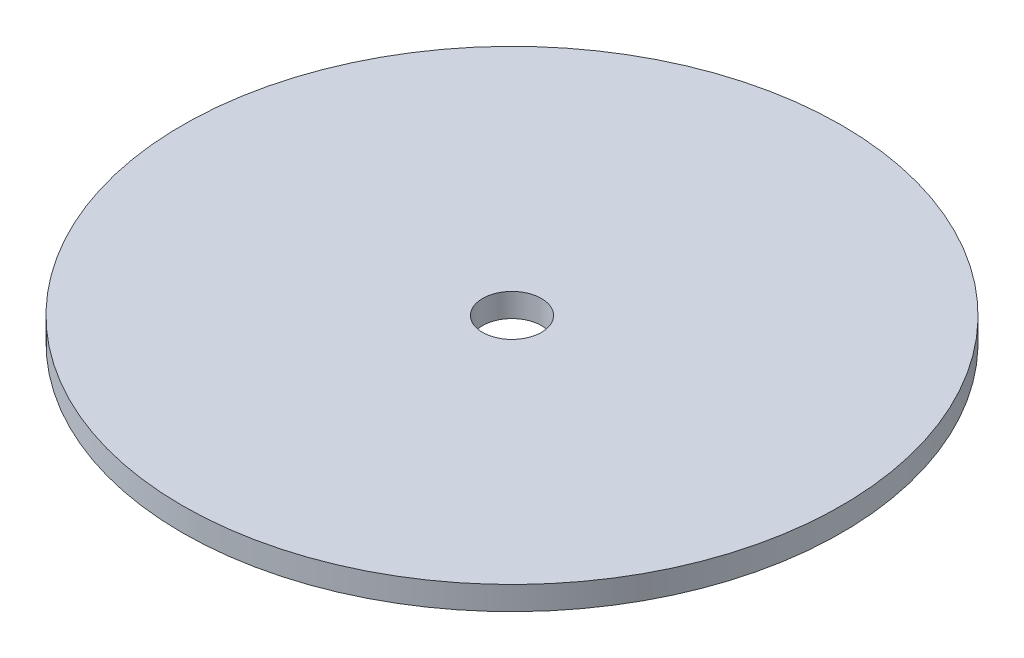
ISO-10303-21;
HEADER;
FILE_DESCRIPTION(('STEP AP214'),'2;1');
FILE_NAME('part.step','',(''),(''),'','','');
FILE_SCHEMA(('AUTOMOTIVE_DESIGN { 1 0 10303 214 1 1 1 1 }'));
ENDSEC;
DATA;
#1=APPLICATION_CONTEXT('core data for automotive mechanical design processes');
#2=APPLICATION_PROTOCOL_DEFINITION('international standard','automotive_design',2000,#1);
#3=PRODUCT_CONTEXT('',#1,'mechanical');
#4=PRODUCT('Part','Part','',(#3));
#5=PRODUCT_RELATED_PRODUCT_CATEGORY('part','',(#4));
#6=PRODUCT_DEFINITION_FORMATION('','',#4);
#7=PRODUCT_DEFINITION_CONTEXT('part definition',#1,'design');
#8=PRODUCT_DEFINITION('design','',#6,#7);
#9=PRODUCT_DEFINITION_SHAPE('','',#8);
#10=(LENGTH_UNIT() NAMED_UNIT(*) SI_UNIT(.MILLI.,.METRE.));
#11=(NAMED_UNIT(*) PLANE_ANGLE_UNIT() SI_UNIT($,.RADIAN.));
#12=(NAMED_UNIT(*) SI_UNIT($,.STERADIAN.) SOLID_ANGLE_UNIT());
#13=UNCERTAINTY_MEASURE_WITH_UNIT(LENGTH_MEASURE(1.E-05),#10,'distance_accuracy_value','');
#14=(GEOMETRIC_REPRESENTATION_CONTEXT(3) GLOBAL_UNCERTAINTY_ASSIGNED_CONTEXT((#13)) GLOBAL_UNIT_ASSIGNED_CONTEXT((#10,
#11,#12)) REPRESENTATION_CONTEXT('',''));
#15=CARTESIAN_POINT('',(0.,0.,0.));
#16=DIRECTION('',(0.,0.,1.));
#17=DIRECTION('',(1.,0.,0.));
#18=AXIS2_PLACEMENT_3D('',#15,#16,#17);
#19=CARTESIAN_POINT('',(0.,0.,0.));
#20=DIRECTION('',(0.,-1.,0.));
#21=DIRECTION('',(0.,0.,-1.));
#22=AXIS2_PLACEMENT_3D('',#19,#20,#21);
#23=CYLINDRICAL_SURFACE('',#22,2.5);
#24=CARTESIAN_POINT('',(0.,0.,0.));
#25=DIRECTION('',(0.,-1.,0.));
#26=DIRECTION('',(0.,0.,-1.));
#27=AXIS2_PLACEMENT_3D('',#24,#25,#26);
#28=CIRCLE('',#27,2.5);
#29=CARTESIAN_POINT('',(0.,0.,-2.5));
#30=VERTEX_POINT('',#29);
#31=EDGE_CURVE('E10',#30,#30,#28,.T.);
#32=ORIENTED_EDGE('',*,*,#31,.T.);
#33=EDGE_LOOP('',(#32));
#34=FACE_BOUND('',#33,.T.);
#35=CARTESIAN_POINT('',(0.,2.,0.));
#36=DIRECTION('',(0.,-1.,0.));
#37=DIRECTION('',(0.,0.,-1.));
#38=AXIS2_PLACEMENT_3D('',#35,#36,#37);
#39=CIRCLE('',#38,2.5);
#40=CARTESIAN_POINT('',(0.,2.,-2.5));
#41=VERTEX_POINT('',#40);
#42=EDGE_CURVE('E46',#41,#41,#39,.T.);
#43=ORIENTED_EDGE('',*,*,#42,.F.);
#44=EDGE_LOOP('',(#43));
#45=FACE_BOUND('',#44,.T.);
#46=ADVANCED_FACE('F32',(#34,#45),#23,.F.);
#47=CARTESIAN_POINT('',(2.5,0.,0.));
#48=DIRECTION('',(0.,-1.,0.));
#49=DIRECTION('',(0.,0.,-1.));
#50=AXIS2_PLACEMENT_3D('',#47,#48,#49);
#51=PLANE('',#50);
#52=CARTESIAN_POINT('',(0.,0.,0.));
#53=DIRECTION('',(0.,-1.,0.));
#54=DIRECTION('',(0.,0.,-1.));
#55=AXIS2_PLACEMENT_3D('',#52,#53,#54);
#56=CIRCLE('',#55,28.);
#57=CARTESIAN_POINT('',(0.,0.,-28.));
#58=VERTEX_POINT('',#57);
#59=EDGE_CURVE('E38',#58,#58,#56,.T.);
#60=ORIENTED_EDGE('',*,*,#59,.T.);
#61=EDGE_LOOP('',(#60));
#62=FACE_BOUND('',#61,.T.);
#63=ORIENTED_EDGE('',*,*,#31,.F.);
#64=EDGE_LOOP('',(#63));
#65=FACE_BOUND('',#64,.T.);
#66=ADVANCED_FACE('F56',(#62,#65),#51,.T.);
#67=CARTESIAN_POINT('',(0.,0.,0.));
#68=DIRECTION('',(0.,-1.,0.));
#69=DIRECTION('',(0.,0.,-1.));
#70=AXIS2_PLACEMENT_3D('',#67,#68,#69);
#71=CYLINDRICAL_SURFACE('',#70,28.);
#72=CARTESIAN_POINT('',(0.,2.,0.));
#73=DIRECTION('',(0.,-1.,0.));
#74=DIRECTION('',(0.,0.,-1.));
#75=AXIS2_PLACEMENT_3D('',#72,#73,#74);
#76=CIRCLE('',#75,28.);
#77=CARTESIAN_POINT('',(0.,2.,-28.));
#78=VERTEX_POINT('',#77);
#79=EDGE_CURVE('E42',#78,#78,#76,.T.);
#80=ORIENTED_EDGE('',*,*,#79,.T.);
#81=EDGE_LOOP('',(#80));
#82=FACE_BOUND('',#81,.T.);
#83=ORIENTED_EDGE('',*,*,#59,.F.);
#84=EDGE_LOOP('',(#83));
#85=FACE_BOUND('',#84,.T.);
#86=ADVANCED_FACE('F60',(#82,#85),#71,.T.);
#87=CARTESIAN_POINT('',(28.,2.,0.));
#88=DIRECTION('',(0.,1.,0.));
#89=DIRECTION('',(0.,0.,1.));
#90=AXIS2_PLACEMENT_3D('',#87,#88,#89);
#91=PLANE('',#90);
#92=ORIENTED_EDGE('',*,*,#42,.T.);
#93=EDGE_LOOP('',(#92));
#94=FACE_BOUND('',#93,.T.);
#95=ORIENTED_EDGE('',*,*,#79,.F.);
#96=EDGE_LOOP('',(#95));
#97=FACE_BOUND('',#96,.T.);
#98=ADVANCED_FACE('F52',(#94,#97),#91,.T.);
#99=CLOSED_SHELL('',(#46,#66,#86,#98));
#100=MANIFOLD_SOLID_BREP('B2',#99);
#101=ADVANCED_BREP_SHAPE_REPRESENTATION('',(#18,#100),#14);
#102=SHAPE_DEFINITION_REPRESENTATION(#9,#101);
ENDSEC;
END-ISO-10303-21;
